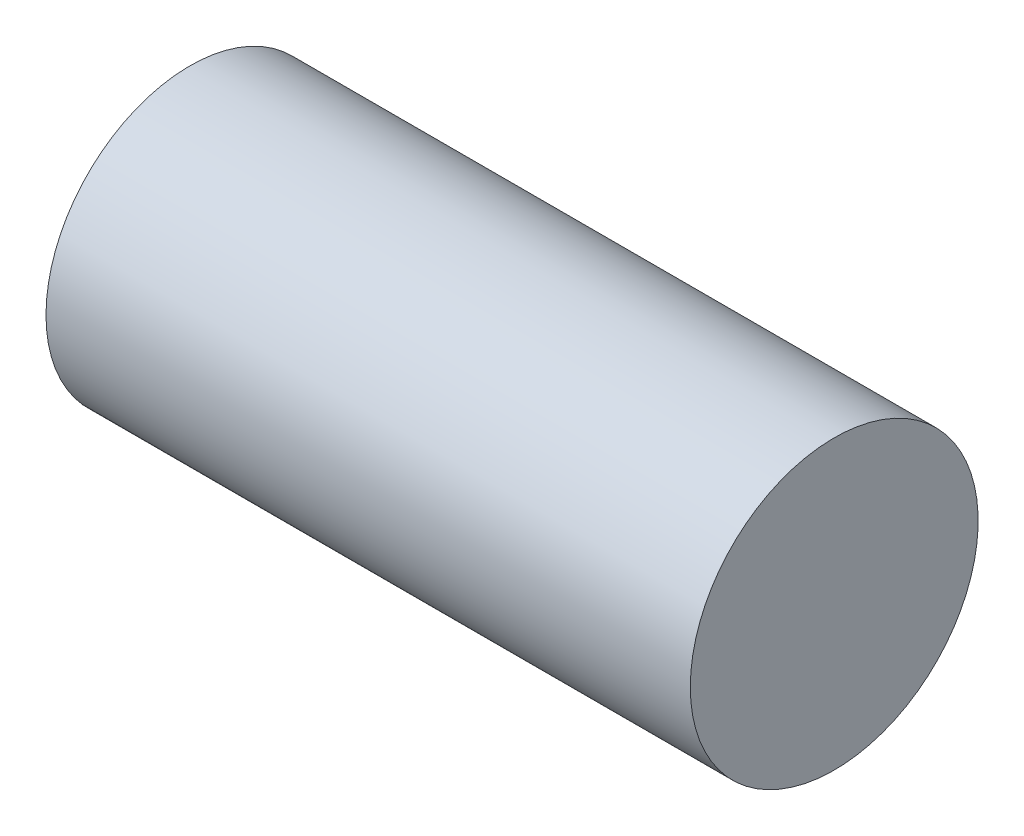
ISO-10303-21;
HEADER;
FILE_DESCRIPTION(('STEP AP214'),'2;1');
FILE_NAME('part.step','',(''),(''),'','','');
FILE_SCHEMA(('AUTOMOTIVE_DESIGN { 1 0 10303 214 1 1 1 1 }'));
ENDSEC;
DATA;
#1=APPLICATION_CONTEXT('core data for automotive mechanical design processes');
#2=APPLICATION_PROTOCOL_DEFINITION('international standard','automotive_design',2000,#1);
#3=PRODUCT_CONTEXT('',#1,'mechanical');
#4=PRODUCT('Part','Part','',(#3));
#5=PRODUCT_RELATED_PRODUCT_CATEGORY('part','',(#4));
#6=PRODUCT_DEFINITION_FORMATION('','',#4);
#7=PRODUCT_DEFINITION_CONTEXT('part definition',#1,'design');
#8=PRODUCT_DEFINITION('design','',#6,#7);
#9=PRODUCT_DEFINITION_SHAPE('','',#8);
#10=(LENGTH_UNIT() NAMED_UNIT(*) SI_UNIT(.MILLI.,.METRE.));
#11=(NAMED_UNIT(*) PLANE_ANGLE_UNIT() SI_UNIT($,.RADIAN.));
#12=(NAMED_UNIT(*) SI_UNIT($,.STERADIAN.) SOLID_ANGLE_UNIT());
#13=UNCERTAINTY_MEASURE_WITH_UNIT(LENGTH_MEASURE(1.E-05),#10,'distance_accuracy_value','');
#14=(GEOMETRIC_REPRESENTATION_CONTEXT(3) GLOBAL_UNCERTAINTY_ASSIGNED_CONTEXT((#13)) GLOBAL_UNIT_ASSIGNED_CONTEXT((#10,
#11,#12)) REPRESENTATION_CONTEXT('',''));
#15=CARTESIAN_POINT('',(0.,0.,0.));
#16=DIRECTION('',(0.,0.,1.));
#17=DIRECTION('',(1.,0.,0.));
#18=AXIS2_PLACEMENT_3D('',#15,#16,#17);
#19=CARTESIAN_POINT('',(-3.27927927927926,-76.6302010509281,61.707987888015));
#20=DIRECTION('',(1.,0.,0.));
#21=DIRECTION('',(0.,0.,-1.));
#22=AXIS2_PLACEMENT_3D('',#19,#20,#21);
#23=CYLINDRICAL_SURFACE('',#22,13.4031184670089);
#24=CARTESIAN_POINT('',(-3.27927927927926,-76.6302010509281,61.707987888015));
#25=DIRECTION('',(-1.,0.,0.));
#26=DIRECTION('',(0.,0.,1.));
#27=AXIS2_PLACEMENT_3D('',#24,#25,#26);
#28=CIRCLE('',#27,13.4031184670089);
#29=CARTESIAN_POINT('',(-3.27927927927926,-76.6302010509281,75.1111063550239));
#30=VERTEX_POINT('',#29);
#31=EDGE_CURVE('E10',#30,#30,#28,.T.);
#32=ORIENTED_EDGE('',*,*,#31,.F.);
#33=EDGE_LOOP('',(#32));
#34=FACE_BOUND('',#33,.T.);
#35=CARTESIAN_POINT('',(56.7207207207207,-76.6302010509281,61.707987888015));
#36=DIRECTION('',(-1.,0.,0.));
#37=DIRECTION('',(0.,0.,1.));
#38=AXIS2_PLACEMENT_3D('',#35,#36,#37);
#39=CIRCLE('',#38,13.4031184670089);
#40=CARTESIAN_POINT('',(56.7207207207207,-76.6302010509281,75.1111063550239));
#41=VERTEX_POINT('',#40);
#42=EDGE_CURVE('E34',#41,#41,#39,.T.);
#43=ORIENTED_EDGE('',*,*,#42,.T.);
#44=EDGE_LOOP('',(#43));
#45=FACE_BOUND('',#44,.T.);
#46=ADVANCED_FACE('F31',(#34,#45),#23,.T.);
#47=CARTESIAN_POINT('',(-3.27927927927926,-76.6302010509281,61.707987888015));
#48=DIRECTION('',(-1.,0.,0.));
#49=DIRECTION('',(0.,0.,1.));
#50=AXIS2_PLACEMENT_3D('',#47,#48,#49);
#51=PLANE('',#50);
#52=ORIENTED_EDGE('',*,*,#31,.T.);
#53=EDGE_LOOP('',(#52));
#54=FACE_BOUND('',#53,.T.);
#55=ADVANCED_FACE('F46',(#54),#51,.T.);
#56=CARTESIAN_POINT('',(56.7207207207207,-76.6302010509281,61.707987888015));
#57=DIRECTION('',(-1.,0.,0.));
#58=DIRECTION('',(0.,0.,1.));
#59=AXIS2_PLACEMENT_3D('',#56,#57,#58);
#60=PLANE('',#59);
#61=ORIENTED_EDGE('',*,*,#42,.F.);
#62=EDGE_LOOP('',(#61));
#63=FACE_BOUND('',#62,.T.);
#64=ADVANCED_FACE('F44',(#63),#60,.F.);
#65=CLOSED_SHELL('',(#46,#55,#64));
#66=MANIFOLD_SOLID_BREP('B2',#65);
#67=ADVANCED_BREP_SHAPE_REPRESENTATION('',(#18,#66),#14);
#68=SHAPE_DEFINITION_REPRESENTATION(#9,#67);
ENDSEC;
END-ISO-10303-21;
